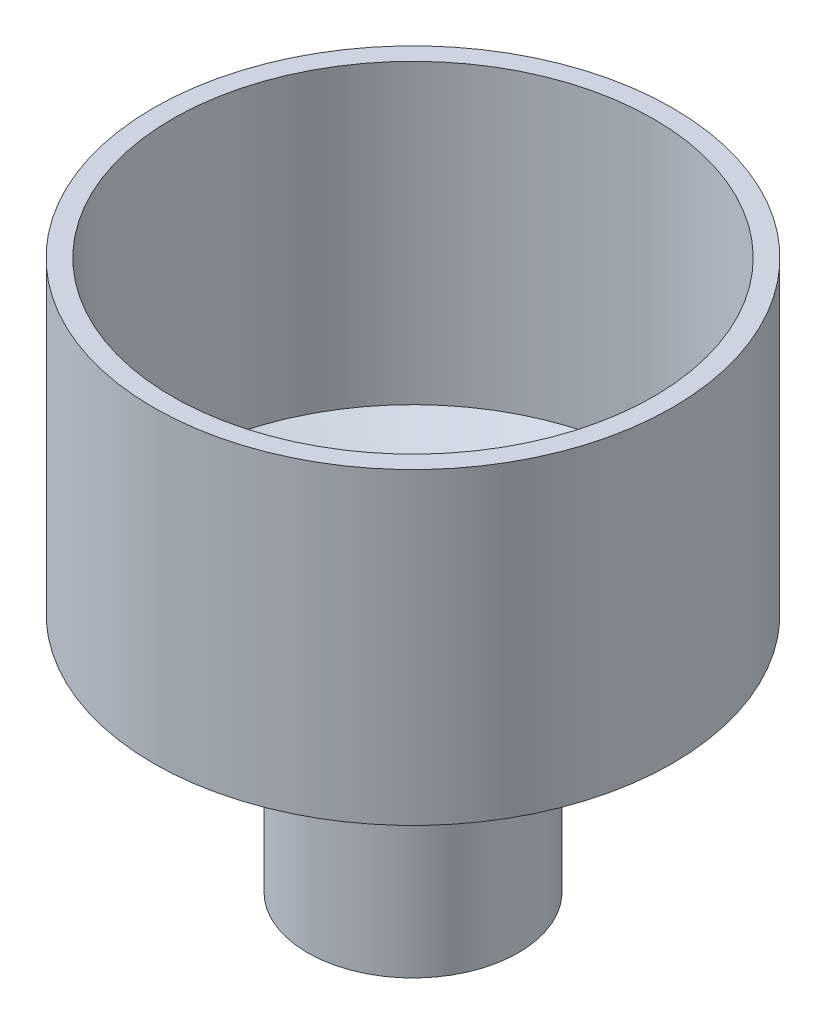
ISO-10303-21;
HEADER;
FILE_DESCRIPTION(('STEP AP214'),'2;1');
FILE_NAME('part.step','',(''),(''),'','','');
FILE_SCHEMA(('AUTOMOTIVE_DESIGN { 1 0 10303 214 1 1 1 1 }'));
ENDSEC;
DATA;
#1=APPLICATION_CONTEXT('core data for automotive mechanical design processes');
#2=APPLICATION_PROTOCOL_DEFINITION('international standard','automotive_design',2000,#1);
#3=PRODUCT_CONTEXT('',#1,'mechanical');
#4=PRODUCT('Part','Part','',(#3));
#5=PRODUCT_RELATED_PRODUCT_CATEGORY('part','',(#4));
#6=PRODUCT_DEFINITION_FORMATION('','',#4);
#7=PRODUCT_DEFINITION_CONTEXT('part definition',#1,'design');
#8=PRODUCT_DEFINITION('design','',#6,#7);
#9=PRODUCT_DEFINITION_SHAPE('','',#8);
#10=(LENGTH_UNIT() NAMED_UNIT(*) SI_UNIT(.MILLI.,.METRE.));
#11=(NAMED_UNIT(*) PLANE_ANGLE_UNIT() SI_UNIT($,.RADIAN.));
#12=(NAMED_UNIT(*) SI_UNIT($,.STERADIAN.) SOLID_ANGLE_UNIT());
#13=UNCERTAINTY_MEASURE_WITH_UNIT(LENGTH_MEASURE(1.E-05),#10,'distance_accuracy_value','');
#14=(GEOMETRIC_REPRESENTATION_CONTEXT(3) GLOBAL_UNCERTAINTY_ASSIGNED_CONTEXT((#13)) GLOBAL_UNIT_ASSIGNED_CONTEXT((#10,
#11,#12)) REPRESENTATION_CONTEXT('',''));
#15=CARTESIAN_POINT('',(0.,0.,0.));
#16=DIRECTION('',(0.,0.,1.));
#17=DIRECTION('',(1.,0.,0.));
#18=AXIS2_PLACEMENT_3D('',#15,#16,#17);
#19=CARTESIAN_POINT('',(-4.02852354649699E-13,101.6,0.));
#20=DIRECTION('',(0.,-1.,0.));
#21=DIRECTION('',(0.,0.,-1.));
#22=AXIS2_PLACEMENT_3D('',#19,#20,#21);
#23=PLANE('',#22);
#24=CARTESIAN_POINT('',(0.,101.6,0.));
#25=DIRECTION('',(0.,-1.,0.));
#26=DIRECTION('',(0.,0.,-1.));
#27=AXIS2_PLACEMENT_3D('',#24,#25,#26);
#28=CIRCLE('',#27,48.);
#29=CARTESIAN_POINT('',(0.,101.6,-48.));
#30=VERTEX_POINT('',#29);
#31=EDGE_CURVE('E66',#30,#30,#28,.T.);
#32=ORIENTED_EDGE('',*,*,#31,.F.);
#33=EDGE_LOOP('',(#32));
#34=FACE_BOUND('',#33,.T.);
#35=CARTESIAN_POINT('',(0.,101.6,0.));
#36=DIRECTION('',(0.,-1.,0.));
#37=DIRECTION('',(0.,0.,-1.));
#38=AXIS2_PLACEMENT_3D('',#35,#36,#37);
#39=CIRCLE('',#38,44.5);
#40=CARTESIAN_POINT('',(0.,101.6,-44.5));
#41=VERTEX_POINT('',#40);
#42=EDGE_CURVE('E10',#41,#41,#39,.T.);
#43=ORIENTED_EDGE('',*,*,#42,.T.);
#44=EDGE_LOOP('',(#43));
#45=FACE_BOUND('',#44,.T.);
#46=ADVANCED_FACE('F38',(#34,#45),#23,.F.);
#47=CARTESIAN_POINT('',(0.,0.,0.));
#48=DIRECTION('',(0.,-1.,0.));
#49=DIRECTION('',(0.,0.,-1.));
#50=AXIS2_PLACEMENT_3D('',#47,#48,#49);
#51=CYLINDRICAL_SURFACE('',#50,44.5);
#52=ORIENTED_EDGE('',*,*,#42,.F.);
#53=EDGE_LOOP('',(#52));
#54=FACE_BOUND('',#53,.T.);
#55=CARTESIAN_POINT('',(0.,46.6,0.));
#56=DIRECTION('',(0.,-1.,0.));
#57=DIRECTION('',(0.,0.,-1.));
#58=AXIS2_PLACEMENT_3D('',#55,#56,#57);
#59=CIRCLE('',#58,44.5);
#60=CARTESIAN_POINT('',(0.,46.6,-44.5));
#61=VERTEX_POINT('',#60);
#62=EDGE_CURVE('E44',#61,#61,#59,.T.);
#63=ORIENTED_EDGE('',*,*,#62,.T.);
#64=EDGE_LOOP('',(#63));
#65=FACE_BOUND('',#64,.T.);
#66=ADVANCED_FACE('F74',(#54,#65),#51,.F.);
#67=CARTESIAN_POINT('',(0.,30.,0.));
#68=DIRECTION('',(0.,1.,0.));
#69=DIRECTION('',(0.,0.,1.));
#70=AXIS2_PLACEMENT_3D('',#67,#68,#69);
#71=CONICAL_SURFACE('',#70,16.,1.04337661419816);
#72=ORIENTED_EDGE('',*,*,#62,.F.);
#73=EDGE_LOOP('',(#72));
#74=FACE_BOUND('',#73,.T.);
#75=CARTESIAN_POINT('',(0.,30.,0.));
#76=DIRECTION('',(0.,-1.,0.));
#77=DIRECTION('',(0.,0.,-1.));
#78=AXIS2_PLACEMENT_3D('',#75,#76,#77);
#79=CIRCLE('',#78,16.);
#80=CARTESIAN_POINT('',(0.,30.,-16.));
#81=VERTEX_POINT('',#80);
#82=EDGE_CURVE('E48',#81,#81,#79,.T.);
#83=ORIENTED_EDGE('',*,*,#82,.T.);
#84=EDGE_LOOP('',(#83));
#85=FACE_BOUND('',#84,.T.);
#86=ADVANCED_FACE('F78',(#74,#85),#71,.F.);
#87=CARTESIAN_POINT('',(0.,0.,0.));
#88=DIRECTION('',(0.,-1.,0.));
#89=DIRECTION('',(0.,0.,-1.));
#90=AXIS2_PLACEMENT_3D('',#87,#88,#89);
#91=CYLINDRICAL_SURFACE('',#90,16.);
#92=ORIENTED_EDGE('',*,*,#82,.F.);
#93=EDGE_LOOP('',(#92));
#94=FACE_BOUND('',#93,.T.);
#95=CARTESIAN_POINT('',(0.,0.,0.));
#96=DIRECTION('',(0.,-1.,0.));
#97=DIRECTION('',(0.,0.,-1.));
#98=AXIS2_PLACEMENT_3D('',#95,#96,#97);
#99=CIRCLE('',#98,16.);
#100=CARTESIAN_POINT('',(0.,0.,-16.));
#101=VERTEX_POINT('',#100);
#102=EDGE_CURVE('E52',#101,#101,#99,.T.);
#103=ORIENTED_EDGE('',*,*,#102,.T.);
#104=EDGE_LOOP('',(#103));
#105=FACE_BOUND('',#104,.T.);
#106=ADVANCED_FACE('F83',(#94,#105),#91,.F.);
#107=CARTESIAN_POINT('',(0.,0.,0.));
#108=DIRECTION('',(0.,-1.,0.));
#109=DIRECTION('',(0.,0.,-1.));
#110=AXIS2_PLACEMENT_3D('',#107,#108,#109);
#111=PLANE('',#110);
#112=CARTESIAN_POINT('',(0.,0.,0.));
#113=DIRECTION('',(0.,-1.,0.));
#114=DIRECTION('',(0.,0.,-1.));
#115=AXIS2_PLACEMENT_3D('',#112,#113,#114);
#116=CIRCLE('',#115,19.5);
#117=CARTESIAN_POINT('',(0.,0.,-19.5));
#118=VERTEX_POINT('',#117);
#119=EDGE_CURVE('E57',#118,#118,#116,.T.);
#120=ORIENTED_EDGE('',*,*,#119,.T.);
#121=EDGE_LOOP('',(#120));
#122=FACE_BOUND('',#121,.T.);
#123=ORIENTED_EDGE('',*,*,#102,.F.);
#124=EDGE_LOOP('',(#123));
#125=FACE_BOUND('',#124,.T.);
#126=ADVANCED_FACE('F89',(#122,#125),#111,.T.);
#127=CARTESIAN_POINT('',(0.,0.,0.));
#128=DIRECTION('',(0.,-1.,0.));
#129=DIRECTION('',(0.,0.,-1.));
#130=AXIS2_PLACEMENT_3D('',#127,#128,#129);
#131=CYLINDRICAL_SURFACE('',#130,19.5);
#132=CARTESIAN_POINT('',(0.,27.9881797652544,0.));
#133=DIRECTION('',(0.,-1.,0.));
#134=DIRECTION('',(0.,0.,-1.));
#135=AXIS2_PLACEMENT_3D('',#132,#133,#134);
#136=CIRCLE('',#135,19.5);
#137=CARTESIAN_POINT('',(0.,27.9881797652544,-19.5));
#138=VERTEX_POINT('',#137);
#139=EDGE_CURVE('E60',#138,#138,#136,.T.);
#140=ORIENTED_EDGE('',*,*,#139,.T.);
#141=EDGE_LOOP('',(#140));
#142=FACE_BOUND('',#141,.T.);
#143=ORIENTED_EDGE('',*,*,#119,.F.);
#144=EDGE_LOOP('',(#143));
#145=FACE_BOUND('',#144,.T.);
#146=ADVANCED_FACE('F93',(#142,#145),#131,.T.);
#147=CARTESIAN_POINT('',(0.,27.9881797652544,0.));
#148=DIRECTION('',(0.,1.,0.));
#149=DIRECTION('',(0.,0.,1.));
#150=AXIS2_PLACEMENT_3D('',#147,#148,#149);
#151=CONICAL_SURFACE('',#150,19.5,1.04337661419816);
#152=CARTESIAN_POINT('',(0.,44.5881797652544,0.));
#153=DIRECTION('',(0.,-1.,0.));
#154=DIRECTION('',(0.,0.,-1.));
#155=AXIS2_PLACEMENT_3D('',#152,#153,#154);
#156=CIRCLE('',#155,48.);
#157=CARTESIAN_POINT('',(0.,44.5881797652544,-48.));
#158=VERTEX_POINT('',#157);
#159=EDGE_CURVE('E63',#158,#158,#156,.T.);
#160=ORIENTED_EDGE('',*,*,#159,.T.);
#161=EDGE_LOOP('',(#160));
#162=FACE_BOUND('',#161,.T.);
#163=ORIENTED_EDGE('',*,*,#139,.F.);
#164=EDGE_LOOP('',(#163));
#165=FACE_BOUND('',#164,.T.);
#166=ADVANCED_FACE('F97',(#162,#165),#151,.T.);
#167=CARTESIAN_POINT('',(0.,0.,0.));
#168=DIRECTION('',(0.,-1.,0.));
#169=DIRECTION('',(0.,0.,-1.));
#170=AXIS2_PLACEMENT_3D('',#167,#168,#169);
#171=CYLINDRICAL_SURFACE('',#170,48.);
#172=ORIENTED_EDGE('',*,*,#31,.T.);
#173=EDGE_LOOP('',(#172));
#174=FACE_BOUND('',#173,.T.);
#175=ORIENTED_EDGE('',*,*,#159,.F.);
#176=EDGE_LOOP('',(#175));
#177=FACE_BOUND('',#176,.T.);
#178=ADVANCED_FACE('F70',(#174,#177),#171,.T.);
#179=CLOSED_SHELL('',(#46,#66,#86,#106,#126,#146,#166,#178));
#180=MANIFOLD_SOLID_BREP('B2',#179);
#181=ADVANCED_BREP_SHAPE_REPRESENTATION('',(#18,#180),#14);
#182=SHAPE_DEFINITION_REPRESENTATION(#9,#181);
ENDSEC;
END-ISO-10303-21;
